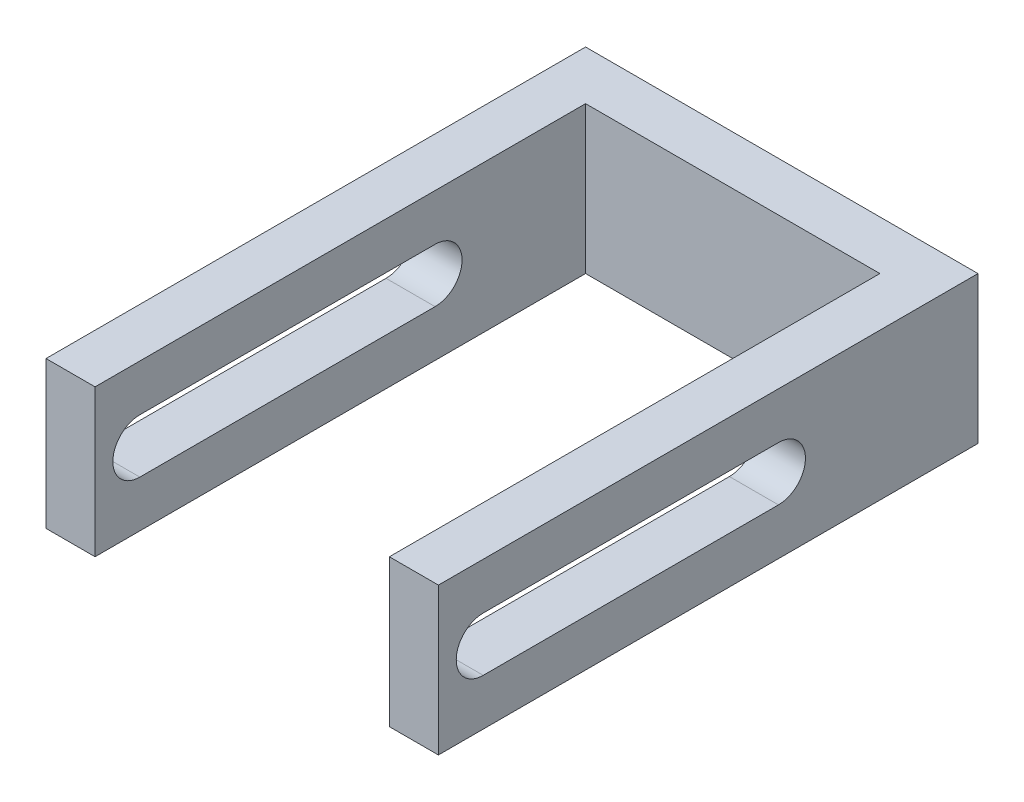
ISO-10303-21;
HEADER;
FILE_DESCRIPTION(('STEP AP214'),'2;1');
FILE_NAME('part.step','',(''),(''),'','','');
FILE_SCHEMA(('AUTOMOTIVE_DESIGN { 1 0 10303 214 1 1 1 1 }'));
ENDSEC;
DATA;
#1=APPLICATION_CONTEXT('core data for automotive mechanical design processes');
#2=APPLICATION_PROTOCOL_DEFINITION('international standard','automotive_design',2000,#1);
#3=PRODUCT_CONTEXT('',#1,'mechanical');
#4=PRODUCT('Part','Part','',(#3));
#5=PRODUCT_RELATED_PRODUCT_CATEGORY('part','',(#4));
#6=PRODUCT_DEFINITION_FORMATION('','',#4);
#7=PRODUCT_DEFINITION_CONTEXT('part definition',#1,'design');
#8=PRODUCT_DEFINITION('design','',#6,#7);
#9=PRODUCT_DEFINITION_SHAPE('','',#8);
#10=(LENGTH_UNIT() NAMED_UNIT(*) SI_UNIT(.MILLI.,.METRE.));
#11=(NAMED_UNIT(*) PLANE_ANGLE_UNIT() SI_UNIT($,.RADIAN.));
#12=(NAMED_UNIT(*) SI_UNIT($,.STERADIAN.) SOLID_ANGLE_UNIT());
#13=UNCERTAINTY_MEASURE_WITH_UNIT(LENGTH_MEASURE(1.E-05),#10,'distance_accuracy_value','');
#14=(GEOMETRIC_REPRESENTATION_CONTEXT(3) GLOBAL_UNCERTAINTY_ASSIGNED_CONTEXT((#13)) GLOBAL_UNIT_ASSIGNED_CONTEXT((#10,
#11,#12)) REPRESENTATION_CONTEXT('',''));
#15=CARTESIAN_POINT('',(0.,0.,0.));
#16=DIRECTION('',(0.,0.,1.));
#17=DIRECTION('',(1.,0.,0.));
#18=AXIS2_PLACEMENT_3D('',#15,#16,#17);
#19=CARTESIAN_POINT('',(0.,15.,-50.));
#20=DIRECTION('',(-1.,0.,0.));
#21=DIRECTION('',(0.,0.,1.));
#22=AXIS2_PLACEMENT_3D('',#19,#20,#21);
#23=PLANE('',#22);
#24=DIRECTION('',(0.,0.,1.));
#25=VECTOR('',#24,1.);
#26=CARTESIAN_POINT('',(0.,4.75,-50.));
#27=LINE('',#26,#25);
#28=CARTESIAN_POINT('',(0.,4.75,-34.659838248675));
#29=VERTEX_POINT('',#28);
#30=CARTESIAN_POINT('',(0.,4.75,-4.56496586889621));
#31=VERTEX_POINT('',#30);
#32=EDGE_CURVE('E213',#29,#31,#27,.T.);
#33=ORIENTED_EDGE('',*,*,#32,.T.);
#34=CARTESIAN_POINT('',(0.,7.5,-4.56496586889621));
#35=DIRECTION('',(-1.,0.,0.));
#36=DIRECTION('',(0.,0.,1.));
#37=AXIS2_PLACEMENT_3D('',#34,#35,#36);
#38=CIRCLE('',#37,2.75);
#39=CARTESIAN_POINT('',(0.,10.25,-4.56496586889621));
#40=VERTEX_POINT('',#39);
#41=EDGE_CURVE('E157',#31,#40,#38,.T.);
#42=ORIENTED_EDGE('',*,*,#41,.T.);
#43=DIRECTION('',(0.,0.,-1.));
#44=VECTOR('',#43,1.);
#45=CARTESIAN_POINT('',(0.,10.25,-50.));
#46=LINE('',#45,#44);
#47=CARTESIAN_POINT('',(0.,10.25,-34.659838248675));
#48=VERTEX_POINT('',#47);
#49=EDGE_CURVE('E228',#40,#48,#46,.T.);
#50=ORIENTED_EDGE('',*,*,#49,.T.);
#51=CARTESIAN_POINT('',(0.,7.5,-34.659838248675));
#52=DIRECTION('',(-1.,0.,0.));
#53=DIRECTION('',(0.,0.,1.));
#54=AXIS2_PLACEMENT_3D('',#51,#52,#53);
#55=CIRCLE('',#54,2.75);
#56=EDGE_CURVE('E220',#48,#29,#55,.T.);
#57=ORIENTED_EDGE('',*,*,#56,.T.);
#58=EDGE_LOOP('',(#33,#42,#50,#57));
#59=FACE_BOUND('',#58,.T.);
#60=DIRECTION('',(0.,0.,-1.));
#61=VECTOR('',#60,1.);
#62=CARTESIAN_POINT('',(0.,0.,-50.));
#63=LINE('',#62,#61);
#64=CARTESIAN_POINT('',(0.,0.,0.));
#65=VERTEX_POINT('',#64);
#66=CARTESIAN_POINT('',(0.,0.,-50.));
#67=VERTEX_POINT('',#66);
#68=EDGE_CURVE('E238',#65,#67,#63,.T.);
#69=ORIENTED_EDGE('',*,*,#68,.T.);
#70=DIRECTION('',(0.,-1.,0.));
#71=VECTOR('',#70,1.);
#72=CARTESIAN_POINT('',(0.,15.,-50.));
#73=LINE('',#72,#71);
#74=CARTESIAN_POINT('',(0.,15.,-50.));
#75=VERTEX_POINT('',#74);
#76=EDGE_CURVE('E11',#75,#67,#73,.T.);
#77=ORIENTED_EDGE('',*,*,#76,.F.);
#78=DIRECTION('',(0.,0.,-1.));
#79=VECTOR('',#78,1.);
#80=CARTESIAN_POINT('',(0.,15.,-50.));
#81=LINE('',#80,#79);
#82=CARTESIAN_POINT('',(0.,15.,0.));
#83=VERTEX_POINT('',#82);
#84=EDGE_CURVE('E239',#83,#75,#81,.T.);
#85=ORIENTED_EDGE('',*,*,#84,.F.);
#86=DIRECTION('',(0.,-1.,0.));
#87=VECTOR('',#86,1.);
#88=CARTESIAN_POINT('',(0.,15.,0.));
#89=LINE('',#88,#87);
#90=EDGE_CURVE('E265',#83,#65,#89,.T.);
#91=ORIENTED_EDGE('',*,*,#90,.T.);
#92=EDGE_LOOP('',(#69,#77,#85,#91));
#93=FACE_BOUND('',#92,.T.);
#94=ADVANCED_FACE('F39',(#59,#93),#23,.F.);
#95=CARTESIAN_POINT('',(30.,15.,-50.));
#96=DIRECTION('',(0.,0.,-1.));
#97=DIRECTION('',(-1.,0.,0.));
#98=AXIS2_PLACEMENT_3D('',#95,#96,#97);
#99=PLANE('',#98);
#100=DIRECTION('',(1.,0.,0.));
#101=VECTOR('',#100,1.);
#102=CARTESIAN_POINT('',(30.,0.,-50.));
#103=LINE('',#102,#101);
#104=CARTESIAN_POINT('',(30.,0.,-50.));
#105=VERTEX_POINT('',#104);
#106=EDGE_CURVE('E269',#67,#105,#103,.T.);
#107=ORIENTED_EDGE('',*,*,#106,.T.);
#108=DIRECTION('',(0.,-1.,0.));
#109=VECTOR('',#108,1.);
#110=CARTESIAN_POINT('',(30.,15.,-50.));
#111=LINE('',#110,#109);
#112=CARTESIAN_POINT('',(30.,15.,-50.));
#113=VERTEX_POINT('',#112);
#114=EDGE_CURVE('E47',#113,#105,#111,.T.);
#115=ORIENTED_EDGE('',*,*,#114,.F.);
#116=DIRECTION('',(1.,0.,0.));
#117=VECTOR('',#116,1.);
#118=CARTESIAN_POINT('',(30.,15.,-50.));
#119=LINE('',#118,#117);
#120=EDGE_CURVE('E243',#75,#113,#119,.T.);
#121=ORIENTED_EDGE('',*,*,#120,.F.);
#122=ORIENTED_EDGE('',*,*,#76,.T.);
#123=EDGE_LOOP('',(#107,#115,#121,#122));
#124=FACE_BOUND('',#123,.T.);
#125=ADVANCED_FACE('F340',(#124),#99,.F.);
#126=CARTESIAN_POINT('',(30.,15.,0.));
#127=DIRECTION('',(1.,0.,0.));
#128=DIRECTION('',(0.,0.,-1.));
#129=AXIS2_PLACEMENT_3D('',#126,#127,#128);
#130=PLANE('',#129);
#131=DIRECTION('',(0.,0.,1.));
#132=VECTOR('',#131,1.);
#133=CARTESIAN_POINT('',(30.,10.25,0.));
#134=LINE('',#133,#132);
#135=CARTESIAN_POINT('',(30.,10.25,-34.659838248675));
#136=VERTEX_POINT('',#135);
#137=CARTESIAN_POINT('',(30.,10.25,-4.56496586889621));
#138=VERTEX_POINT('',#137);
#139=EDGE_CURVE('E224',#136,#138,#134,.T.);
#140=ORIENTED_EDGE('',*,*,#139,.T.);
#141=CARTESIAN_POINT('',(30.,7.5,-4.56496586889621));
#142=DIRECTION('',(1.,0.,0.));
#143=DIRECTION('',(0.,0.,-1.));
#144=AXIS2_PLACEMENT_3D('',#141,#142,#143);
#145=CIRCLE('',#144,2.75);
#146=CARTESIAN_POINT('',(30.,4.75,-4.56496586889621));
#147=VERTEX_POINT('',#146);
#148=EDGE_CURVE('E232',#138,#147,#145,.T.);
#149=ORIENTED_EDGE('',*,*,#148,.T.);
#150=DIRECTION('',(0.,0.,-1.));
#151=VECTOR('',#150,1.);
#152=CARTESIAN_POINT('',(30.,4.75,0.));
#153=LINE('',#152,#151);
#154=CARTESIAN_POINT('',(30.,4.75,-34.659838248675));
#155=VERTEX_POINT('',#154);
#156=EDGE_CURVE('E201',#147,#155,#153,.T.);
#157=ORIENTED_EDGE('',*,*,#156,.T.);
#158=CARTESIAN_POINT('',(30.,7.5,-34.659838248675));
#159=DIRECTION('',(1.,0.,0.));
#160=DIRECTION('',(0.,0.,-1.));
#161=AXIS2_PLACEMENT_3D('',#158,#159,#160);
#162=CIRCLE('',#161,2.75);
#163=EDGE_CURVE('E216',#155,#136,#162,.T.);
#164=ORIENTED_EDGE('',*,*,#163,.T.);
#165=EDGE_LOOP('',(#140,#149,#157,#164));
#166=FACE_BOUND('',#165,.T.);
#167=DIRECTION('',(0.,0.,1.));
#168=VECTOR('',#167,1.);
#169=CARTESIAN_POINT('',(30.,0.,0.));
#170=LINE('',#169,#168);
#171=CARTESIAN_POINT('',(30.,0.,0.));
#172=VERTEX_POINT('',#171);
#173=EDGE_CURVE('E272',#105,#172,#170,.T.);
#174=ORIENTED_EDGE('',*,*,#173,.T.);
#175=DIRECTION('',(0.,-1.,0.));
#176=VECTOR('',#175,1.);
#177=CARTESIAN_POINT('',(30.,15.,0.));
#178=LINE('',#177,#176);
#179=CARTESIAN_POINT('',(30.,15.,0.));
#180=VERTEX_POINT('',#179);
#181=EDGE_CURVE('E309',#180,#172,#178,.T.);
#182=ORIENTED_EDGE('',*,*,#181,.F.);
#183=DIRECTION('',(0.,0.,1.));
#184=VECTOR('',#183,1.);
#185=CARTESIAN_POINT('',(30.,15.,0.));
#186=LINE('',#185,#184);
#187=EDGE_CURVE('E247',#113,#180,#186,.T.);
#188=ORIENTED_EDGE('',*,*,#187,.F.);
#189=ORIENTED_EDGE('',*,*,#114,.T.);
#190=EDGE_LOOP('',(#174,#182,#188,#189));
#191=FACE_BOUND('',#190,.T.);
#192=ADVANCED_FACE('F318',(#166,#191),#130,.F.);
#193=CARTESIAN_POINT('',(35.,15.,0.));
#194=DIRECTION('',(0.,0.,-1.));
#195=DIRECTION('',(-1.,0.,0.));
#196=AXIS2_PLACEMENT_3D('',#193,#194,#195);
#197=PLANE('',#196);
#198=DIRECTION('',(1.,0.,0.));
#199=VECTOR('',#198,1.);
#200=CARTESIAN_POINT('',(35.,0.,0.));
#201=LINE('',#200,#199);
#202=CARTESIAN_POINT('',(35.,0.,0.));
#203=VERTEX_POINT('',#202);
#204=EDGE_CURVE('E275',#172,#203,#201,.T.);
#205=ORIENTED_EDGE('',*,*,#204,.T.);
#206=DIRECTION('',(0.,-1.,0.));
#207=VECTOR('',#206,1.);
#208=CARTESIAN_POINT('',(35.,15.,0.));
#209=LINE('',#208,#207);
#210=CARTESIAN_POINT('',(35.,15.,0.));
#211=VERTEX_POINT('',#210);
#212=EDGE_CURVE('E305',#211,#203,#209,.T.);
#213=ORIENTED_EDGE('',*,*,#212,.F.);
#214=DIRECTION('',(1.,0.,0.));
#215=VECTOR('',#214,1.);
#216=CARTESIAN_POINT('',(35.,15.,0.));
#217=LINE('',#216,#215);
#218=EDGE_CURVE('E250',#180,#211,#217,.T.);
#219=ORIENTED_EDGE('',*,*,#218,.F.);
#220=ORIENTED_EDGE('',*,*,#181,.T.);
#221=EDGE_LOOP('',(#205,#213,#219,#220));
#222=FACE_BOUND('',#221,.T.);
#223=ADVANCED_FACE('F328',(#222),#197,.F.);
#224=CARTESIAN_POINT('',(35.,15.,-55.));
#225=DIRECTION('',(-1.,0.,0.));
#226=DIRECTION('',(0.,0.,1.));
#227=AXIS2_PLACEMENT_3D('',#224,#225,#226);
#228=PLANE('',#227);
#229=DIRECTION('',(0.,0.,-1.));
#230=VECTOR('',#229,1.);
#231=CARTESIAN_POINT('',(35.,4.75,-4.56496586889621));
#232=LINE('',#231,#230);
#233=CARTESIAN_POINT('',(35.,4.75,-4.56496586889621));
#234=VERTEX_POINT('',#233);
#235=CARTESIAN_POINT('',(35.,4.75,-34.659838248675));
#236=VERTEX_POINT('',#235);
#237=EDGE_CURVE('E192',#234,#236,#232,.T.);
#238=ORIENTED_EDGE('',*,*,#237,.F.);
#239=CARTESIAN_POINT('',(35.,7.5,-4.56496586889621));
#240=DIRECTION('',(1.,0.,0.));
#241=DIRECTION('',(0.,0.,-1.));
#242=AXIS2_PLACEMENT_3D('',#239,#240,#241);
#243=CIRCLE('',#242,2.75);
#244=CARTESIAN_POINT('',(35.,10.25,-4.56496586889621));
#245=VERTEX_POINT('',#244);
#246=EDGE_CURVE('E189',#245,#234,#243,.T.);
#247=ORIENTED_EDGE('',*,*,#246,.F.);
#248=DIRECTION('',(0.,0.,1.));
#249=VECTOR('',#248,1.);
#250=CARTESIAN_POINT('',(35.,10.25,-4.56496586889621));
#251=LINE('',#250,#249);
#252=CARTESIAN_POINT('',(35.,10.25,-34.659838248675));
#253=VERTEX_POINT('',#252);
#254=EDGE_CURVE('E178',#253,#245,#251,.T.);
#255=ORIENTED_EDGE('',*,*,#254,.F.);
#256=CARTESIAN_POINT('',(35.,7.5,-34.659838248675));
#257=DIRECTION('',(1.,0.,0.));
#258=DIRECTION('',(0.,0.,-1.));
#259=AXIS2_PLACEMENT_3D('',#256,#257,#258);
#260=CIRCLE('',#259,2.75);
#261=EDGE_CURVE('E182',#236,#253,#260,.T.);
#262=ORIENTED_EDGE('',*,*,#261,.F.);
#263=EDGE_LOOP('',(#238,#247,#255,#262));
#264=FACE_BOUND('',#263,.T.);
#265=DIRECTION('',(0.,0.,-1.));
#266=VECTOR('',#265,1.);
#267=CARTESIAN_POINT('',(35.,0.,-55.));
#268=LINE('',#267,#266);
#269=CARTESIAN_POINT('',(35.,0.,-55.));
#270=VERTEX_POINT('',#269);
#271=EDGE_CURVE('E278',#203,#270,#268,.T.);
#272=ORIENTED_EDGE('',*,*,#271,.T.);
#273=DIRECTION('',(0.,-1.,0.));
#274=VECTOR('',#273,1.);
#275=CARTESIAN_POINT('',(35.,15.,-55.));
#276=LINE('',#275,#274);
#277=CARTESIAN_POINT('',(35.,15.,-55.));
#278=VERTEX_POINT('',#277);
#279=EDGE_CURVE('E301',#278,#270,#276,.T.);
#280=ORIENTED_EDGE('',*,*,#279,.F.);
#281=DIRECTION('',(0.,0.,-1.));
#282=VECTOR('',#281,1.);
#283=CARTESIAN_POINT('',(35.,15.,-55.));
#284=LINE('',#283,#282);
#285=EDGE_CURVE('E253',#211,#278,#284,.T.);
#286=ORIENTED_EDGE('',*,*,#285,.F.);
#287=ORIENTED_EDGE('',*,*,#212,.T.);
#288=EDGE_LOOP('',(#272,#280,#286,#287));
#289=FACE_BOUND('',#288,.T.);
#290=ADVANCED_FACE('F332',(#264,#289),#228,.F.);
#291=CARTESIAN_POINT('',(-5.,15.,-55.));
#292=DIRECTION('',(0.,0.,1.));
#293=DIRECTION('',(1.,0.,0.));
#294=AXIS2_PLACEMENT_3D('',#291,#292,#293);
#295=PLANE('',#294);
#296=DIRECTION('',(-1.,0.,0.));
#297=VECTOR('',#296,1.);
#298=CARTESIAN_POINT('',(-5.,0.,-55.));
#299=LINE('',#298,#297);
#300=CARTESIAN_POINT('',(-5.,0.,-55.));
#301=VERTEX_POINT('',#300);
#302=EDGE_CURVE('E282',#270,#301,#299,.T.);
#303=ORIENTED_EDGE('',*,*,#302,.T.);
#304=DIRECTION('',(0.,-1.,0.));
#305=VECTOR('',#304,1.);
#306=CARTESIAN_POINT('',(-5.,15.,-55.));
#307=LINE('',#306,#305);
#308=CARTESIAN_POINT('',(-5.,15.,-55.));
#309=VERTEX_POINT('',#308);
#310=EDGE_CURVE('E297',#309,#301,#307,.T.);
#311=ORIENTED_EDGE('',*,*,#310,.F.);
#312=DIRECTION('',(-1.,0.,0.));
#313=VECTOR('',#312,1.);
#314=CARTESIAN_POINT('',(23.9655172413792,15.,-55.));
#315=LINE('',#314,#313);
#316=EDGE_CURVE('E256',#278,#309,#315,.T.);
#317=ORIENTED_EDGE('',*,*,#316,.F.);
#318=ORIENTED_EDGE('',*,*,#279,.T.);
#319=EDGE_LOOP('',(#303,#311,#317,#318));
#320=FACE_BOUND('',#319,.T.);
#321=ADVANCED_FACE('F351',(#320),#295,.F.);
#322=CARTESIAN_POINT('',(-5.,15.,0.));
#323=DIRECTION('',(1.,0.,0.));
#324=DIRECTION('',(0.,0.,-1.));
#325=AXIS2_PLACEMENT_3D('',#322,#323,#324);
#326=PLANE('',#325);
#327=DIRECTION('',(0.,0.,1.));
#328=VECTOR('',#327,1.);
#329=CARTESIAN_POINT('',(-5.,10.25,-4.56496586889621));
#330=LINE('',#329,#328);
#331=CARTESIAN_POINT('',(-5.,10.25,-34.659838248675));
#332=VERTEX_POINT('',#331);
#333=CARTESIAN_POINT('',(-5.,10.25,-4.56496586889621));
#334=VERTEX_POINT('',#333);
#335=EDGE_CURVE('E176',#332,#334,#330,.T.);
#336=ORIENTED_EDGE('',*,*,#335,.T.);
#337=CARTESIAN_POINT('',(-5.,7.5,-4.56496586889621));
#338=DIRECTION('',(1.,0.,0.));
#339=DIRECTION('',(0.,0.,-1.));
#340=AXIS2_PLACEMENT_3D('',#337,#338,#339);
#341=CIRCLE('',#340,2.75);
#342=CARTESIAN_POINT('',(-5.,4.75,-4.56496586889621));
#343=VERTEX_POINT('',#342);
#344=EDGE_CURVE('E154',#334,#343,#341,.T.);
#345=ORIENTED_EDGE('',*,*,#344,.T.);
#346=DIRECTION('',(0.,0.,-1.));
#347=VECTOR('',#346,1.);
#348=CARTESIAN_POINT('',(-5.,4.75,-4.56496586889621));
#349=LINE('',#348,#347);
#350=CARTESIAN_POINT('',(-5.,4.75,-34.659838248675));
#351=VERTEX_POINT('',#350);
#352=EDGE_CURVE('E164',#343,#351,#349,.T.);
#353=ORIENTED_EDGE('',*,*,#352,.T.);
#354=CARTESIAN_POINT('',(-5.,7.5,-34.659838248675));
#355=DIRECTION('',(1.,0.,0.));
#356=DIRECTION('',(0.,0.,-1.));
#357=AXIS2_PLACEMENT_3D('',#354,#355,#356);
#358=CIRCLE('',#357,2.75);
#359=EDGE_CURVE('E171',#351,#332,#358,.T.);
#360=ORIENTED_EDGE('',*,*,#359,.T.);
#361=EDGE_LOOP('',(#336,#345,#353,#360));
#362=FACE_BOUND('',#361,.T.);
#363=DIRECTION('',(0.,0.,1.));
#364=VECTOR('',#363,1.);
#365=CARTESIAN_POINT('',(-5.,0.,0.));
#366=LINE('',#365,#364);
#367=CARTESIAN_POINT('',(-5.,0.,0.));
#368=VERTEX_POINT('',#367);
#369=EDGE_CURVE('E285',#301,#368,#366,.T.);
#370=ORIENTED_EDGE('',*,*,#369,.T.);
#371=DIRECTION('',(0.,-1.,0.));
#372=VECTOR('',#371,1.);
#373=CARTESIAN_POINT('',(-5.,15.,0.));
#374=LINE('',#373,#372);
#375=CARTESIAN_POINT('',(-5.,15.,0.));
#376=VERTEX_POINT('',#375);
#377=EDGE_CURVE('E293',#376,#368,#374,.T.);
#378=ORIENTED_EDGE('',*,*,#377,.F.);
#379=DIRECTION('',(0.,0.,1.));
#380=VECTOR('',#379,1.);
#381=CARTESIAN_POINT('',(-5.,15.,0.));
#382=LINE('',#381,#380);
#383=EDGE_CURVE('E259',#309,#376,#382,.T.);
#384=ORIENTED_EDGE('',*,*,#383,.F.);
#385=ORIENTED_EDGE('',*,*,#310,.T.);
#386=EDGE_LOOP('',(#370,#378,#384,#385));
#387=FACE_BOUND('',#386,.T.);
#388=ADVANCED_FACE('F173',(#362,#387),#326,.F.);
#389=CARTESIAN_POINT('',(0.,15.,0.));
#390=DIRECTION('',(0.,0.,-1.));
#391=DIRECTION('',(-1.,0.,0.));
#392=AXIS2_PLACEMENT_3D('',#389,#390,#391);
#393=PLANE('',#392);
#394=DIRECTION('',(1.,0.,0.));
#395=VECTOR('',#394,1.);
#396=CARTESIAN_POINT('',(0.,0.,0.));
#397=LINE('',#396,#395);
#398=EDGE_CURVE('E244',#368,#65,#397,.T.);
#399=ORIENTED_EDGE('',*,*,#398,.T.);
#400=ORIENTED_EDGE('',*,*,#90,.F.);
#401=DIRECTION('',(1.,0.,0.));
#402=VECTOR('',#401,1.);
#403=CARTESIAN_POINT('',(0.,15.,0.));
#404=LINE('',#403,#402);
#405=EDGE_CURVE('E262',#376,#83,#404,.T.);
#406=ORIENTED_EDGE('',*,*,#405,.F.);
#407=ORIENTED_EDGE('',*,*,#377,.T.);
#408=EDGE_LOOP('',(#399,#400,#406,#407));
#409=FACE_BOUND('',#408,.T.);
#410=ADVANCED_FACE('F346',(#409),#393,.F.);
#411=CARTESIAN_POINT('',(0.,15.,0.));
#412=DIRECTION('',(0.,-1.,0.));
#413=DIRECTION('',(0.,0.,-1.));
#414=AXIS2_PLACEMENT_3D('',#411,#412,#413);
#415=PLANE('',#414);
#416=ORIENTED_EDGE('',*,*,#84,.T.);
#417=ORIENTED_EDGE('',*,*,#120,.T.);
#418=ORIENTED_EDGE('',*,*,#187,.T.);
#419=ORIENTED_EDGE('',*,*,#218,.T.);
#420=ORIENTED_EDGE('',*,*,#285,.T.);
#421=ORIENTED_EDGE('',*,*,#316,.T.);
#422=ORIENTED_EDGE('',*,*,#383,.T.);
#423=ORIENTED_EDGE('',*,*,#405,.T.);
#424=EDGE_LOOP('',(#416,#417,#418,#419,#420,#421,#422,#423));
#425=FACE_BOUND('',#424,.T.);
#426=ADVANCED_FACE('F336',(#425),#415,.F.);
#427=CARTESIAN_POINT('',(0.,0.,0.));
#428=DIRECTION('',(0.,-1.,0.));
#429=DIRECTION('',(0.,0.,-1.));
#430=AXIS2_PLACEMENT_3D('',#427,#428,#429);
#431=PLANE('',#430);
#432=ORIENTED_EDGE('',*,*,#68,.F.);
#433=ORIENTED_EDGE('',*,*,#398,.F.);
#434=ORIENTED_EDGE('',*,*,#369,.F.);
#435=ORIENTED_EDGE('',*,*,#302,.F.);
#436=ORIENTED_EDGE('',*,*,#271,.F.);
#437=ORIENTED_EDGE('',*,*,#204,.F.);
#438=ORIENTED_EDGE('',*,*,#173,.F.);
#439=ORIENTED_EDGE('',*,*,#106,.F.);
#440=EDGE_LOOP('',(#432,#433,#434,#435,#436,#437,#438,#439));
#441=FACE_BOUND('',#440,.T.);
#442=ADVANCED_FACE('F324',(#441),#431,.T.);
#443=CARTESIAN_POINT('',(-5.,4.75,-4.56496586889621));
#444=DIRECTION('',(0.,-1.,0.));
#445=DIRECTION('',(0.,0.,-1.));
#446=AXIS2_PLACEMENT_3D('',#443,#444,#445);
#447=PLANE('',#446);
#448=DIRECTION('',(1.,0.,0.));
#449=VECTOR('',#448,1.);
#450=CARTESIAN_POINT('',(-5.,4.75,-34.659838248675));
#451=LINE('',#450,#449);
#452=EDGE_CURVE('E167',#351,#29,#451,.T.);
#453=ORIENTED_EDGE('',*,*,#452,.F.);
#454=ORIENTED_EDGE('',*,*,#352,.F.);
#455=DIRECTION('',(1.,0.,0.));
#456=VECTOR('',#455,1.);
#457=CARTESIAN_POINT('',(-5.,4.75,-4.56496586889621));
#458=LINE('',#457,#456);
#459=EDGE_CURVE('E54',#343,#31,#458,.T.);
#460=ORIENTED_EDGE('',*,*,#459,.T.);
#461=ORIENTED_EDGE('',*,*,#32,.F.);
#462=EDGE_LOOP('',(#453,#454,#460,#461));
#463=FACE_BOUND('',#462,.T.);
#464=ADVANCED_FACE('F165',(#463),#447,.F.);
#465=CARTESIAN_POINT('',(-5.,7.5,-34.659838248675));
#466=DIRECTION('',(1.,0.,0.));
#467=DIRECTION('',(0.,0.,-1.));
#468=AXIS2_PLACEMENT_3D('',#465,#466,#467);
#469=CYLINDRICAL_SURFACE('',#468,2.75);
#470=DIRECTION('',(1.,0.,0.));
#471=VECTOR('',#470,1.);
#472=CARTESIAN_POINT('',(-5.,10.25,-34.659838248675));
#473=LINE('',#472,#471);
#474=EDGE_CURVE('E203',#332,#48,#473,.T.);
#475=ORIENTED_EDGE('',*,*,#474,.F.);
#476=ORIENTED_EDGE('',*,*,#359,.F.);
#477=ORIENTED_EDGE('',*,*,#452,.T.);
#478=ORIENTED_EDGE('',*,*,#56,.F.);
#479=EDGE_LOOP('',(#475,#476,#477,#478));
#480=FACE_BOUND('',#479,.T.);
#481=ADVANCED_FACE('F367',(#480),#469,.F.);
#482=CARTESIAN_POINT('',(-5.,10.25,-4.56496586889621));
#483=DIRECTION('',(0.,1.,0.));
#484=DIRECTION('',(0.,0.,1.));
#485=AXIS2_PLACEMENT_3D('',#482,#483,#484);
#486=PLANE('',#485);
#487=DIRECTION('',(1.,0.,0.));
#488=VECTOR('',#487,1.);
#489=CARTESIAN_POINT('',(-5.,10.25,-4.56496586889621));
#490=LINE('',#489,#488);
#491=EDGE_CURVE('E198',#334,#40,#490,.T.);
#492=ORIENTED_EDGE('',*,*,#491,.F.);
#493=ORIENTED_EDGE('',*,*,#335,.F.);
#494=ORIENTED_EDGE('',*,*,#474,.T.);
#495=ORIENTED_EDGE('',*,*,#49,.F.);
#496=EDGE_LOOP('',(#492,#493,#494,#495));
#497=FACE_BOUND('',#496,.T.);
#498=ADVANCED_FACE('F369',(#497),#486,.F.);
#499=CARTESIAN_POINT('',(-5.,7.5,-4.56496586889621));
#500=DIRECTION('',(1.,0.,0.));
#501=DIRECTION('',(0.,0.,-1.));
#502=AXIS2_PLACEMENT_3D('',#499,#500,#501);
#503=CYLINDRICAL_SURFACE('',#502,2.75);
#504=ORIENTED_EDGE('',*,*,#459,.F.);
#505=ORIENTED_EDGE('',*,*,#344,.F.);
#506=ORIENTED_EDGE('',*,*,#491,.T.);
#507=ORIENTED_EDGE('',*,*,#41,.F.);
#508=EDGE_LOOP('',(#504,#505,#506,#507));
#509=FACE_BOUND('',#508,.T.);
#510=ADVANCED_FACE('F151',(#509),#503,.F.);
#511=EDGE_CURVE('E202',#138,#245,#490,.T.);
#512=ORIENTED_EDGE('',*,*,#511,.T.);
#513=ORIENTED_EDGE('',*,*,#246,.T.);
#514=EDGE_CURVE('E160',#147,#234,#458,.T.);
#515=ORIENTED_EDGE('',*,*,#514,.F.);
#516=ORIENTED_EDGE('',*,*,#148,.F.);
#517=EDGE_LOOP('',(#512,#513,#515,#516));
#518=FACE_BOUND('',#517,.T.);
#519=ADVANCED_FACE('F377',(#518),#503,.F.);
#520=EDGE_CURVE('E207',#136,#253,#473,.T.);
#521=ORIENTED_EDGE('',*,*,#520,.T.);
#522=ORIENTED_EDGE('',*,*,#254,.T.);
#523=ORIENTED_EDGE('',*,*,#511,.F.);
#524=ORIENTED_EDGE('',*,*,#139,.F.);
#525=EDGE_LOOP('',(#521,#522,#523,#524));
#526=FACE_BOUND('',#525,.T.);
#527=ADVANCED_FACE('F372',(#526),#486,.F.);
#528=EDGE_CURVE('E62',#155,#236,#451,.T.);
#529=ORIENTED_EDGE('',*,*,#528,.T.);
#530=ORIENTED_EDGE('',*,*,#261,.T.);
#531=ORIENTED_EDGE('',*,*,#520,.F.);
#532=ORIENTED_EDGE('',*,*,#163,.F.);
#533=EDGE_LOOP('',(#529,#530,#531,#532));
#534=FACE_BOUND('',#533,.T.);
#535=ADVANCED_FACE('F380',(#534),#469,.F.);
#536=ORIENTED_EDGE('',*,*,#514,.T.);
#537=ORIENTED_EDGE('',*,*,#237,.T.);
#538=ORIENTED_EDGE('',*,*,#528,.F.);
#539=ORIENTED_EDGE('',*,*,#156,.F.);
#540=EDGE_LOOP('',(#536,#537,#538,#539));
#541=FACE_BOUND('',#540,.T.);
#542=ADVANCED_FACE('F387',(#541),#447,.F.);
#543=CLOSED_SHELL('',(#94,#125,#192,#223,#290,#321,#388,#410,#426,#442,#464,#481,#498,#510,#519,
#527,#535,#542));
#544=MANIFOLD_SOLID_BREP('B2',#543);
#545=ADVANCED_BREP_SHAPE_REPRESENTATION('',(#18,#544),#14);
#546=SHAPE_DEFINITION_REPRESENTATION(#9,#545);
ENDSEC;
END-ISO-10303-21;
